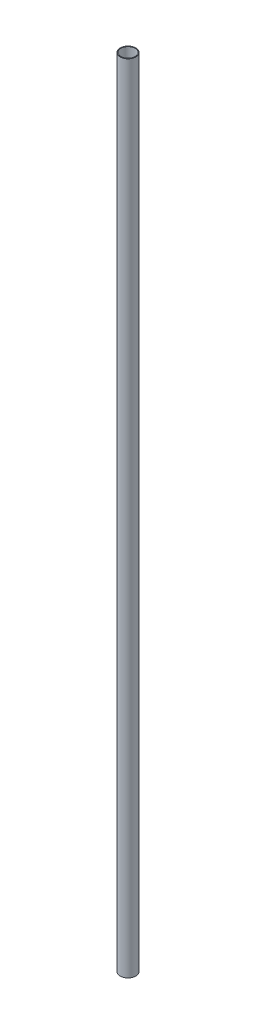
ISO-10303-21;
HEADER;
FILE_DESCRIPTION(('STEP AP214'),'2;1');
FILE_NAME('part.step','',(''),(''),'','','');
FILE_SCHEMA(('AUTOMOTIVE_DESIGN { 1 0 10303 214 1 1 1 1 }'));
ENDSEC;
DATA;
#1=APPLICATION_CONTEXT('core data for automotive mechanical design processes');
#2=APPLICATION_PROTOCOL_DEFINITION('international standard','automotive_design',2000,#1);
#3=PRODUCT_CONTEXT('',#1,'mechanical');
#4=PRODUCT('Part','Part','',(#3));
#5=PRODUCT_RELATED_PRODUCT_CATEGORY('part','',(#4));
#6=PRODUCT_DEFINITION_FORMATION('','',#4);
#7=PRODUCT_DEFINITION_CONTEXT('part definition',#1,'design');
#8=PRODUCT_DEFINITION('design','',#6,#7);
#9=PRODUCT_DEFINITION_SHAPE('','',#8);
#10=(LENGTH_UNIT() NAMED_UNIT(*) SI_UNIT(.MILLI.,.METRE.));
#11=(NAMED_UNIT(*) PLANE_ANGLE_UNIT() SI_UNIT($,.RADIAN.));
#12=(NAMED_UNIT(*) SI_UNIT($,.STERADIAN.) SOLID_ANGLE_UNIT());
#13=UNCERTAINTY_MEASURE_WITH_UNIT(LENGTH_MEASURE(1.E-05),#10,'distance_accuracy_value','');
#14=(GEOMETRIC_REPRESENTATION_CONTEXT(3) GLOBAL_UNCERTAINTY_ASSIGNED_CONTEXT((#13)) GLOBAL_UNIT_ASSIGNED_CONTEXT((#10,
#11,#12)) REPRESENTATION_CONTEXT('',''));
#15=CARTESIAN_POINT('',(0.,0.,0.));
#16=DIRECTION('',(0.,0.,1.));
#17=DIRECTION('',(1.,0.,0.));
#18=AXIS2_PLACEMENT_3D('',#15,#16,#17);
#19=CARTESIAN_POINT('',(0.,1066.8,0.));
#20=DIRECTION('',(0.,1.,0.));
#21=DIRECTION('',(0.,0.,1.));
#22=AXIS2_PLACEMENT_3D('',#19,#20,#21);
#23=PLANE('',#22);
#24=CARTESIAN_POINT('',(0.,1066.8,0.));
#25=DIRECTION('',(0.,1.,0.));
#26=DIRECTION('',(0.,0.,1.));
#27=AXIS2_PLACEMENT_3D('',#24,#25,#26);
#28=CIRCLE('',#27,10.541);
#29=CARTESIAN_POINT('',(0.,1066.8,10.541));
#30=VERTEX_POINT('',#29);
#31=EDGE_CURVE('E12',#30,#30,#28,.T.);
#32=ORIENTED_EDGE('',*,*,#31,.T.);
#33=EDGE_LOOP('',(#32));
#34=FACE_BOUND('',#33,.T.);
#35=CARTESIAN_POINT('',(0.,1066.8,0.));
#36=DIRECTION('',(0.,1.,0.));
#37=DIRECTION('',(0.,0.,1.));
#38=AXIS2_PLACEMENT_3D('',#35,#36,#37);
#39=CIRCLE('',#38,9.525);
#40=CARTESIAN_POINT('',(0.,1066.8,9.525));
#41=VERTEX_POINT('',#40);
#42=EDGE_CURVE('E62',#41,#41,#39,.T.);
#43=ORIENTED_EDGE('',*,*,#42,.F.);
#44=EDGE_LOOP('',(#43));
#45=FACE_BOUND('',#44,.T.);
#46=ADVANCED_FACE('F48',(#34,#45),#23,.T.);
#47=CARTESIAN_POINT('',(0.,0.,0.));
#48=DIRECTION('',(0.,1.,0.));
#49=DIRECTION('',(0.,0.,1.));
#50=AXIS2_PLACEMENT_3D('',#47,#48,#49);
#51=PLANE('',#50);
#52=CARTESIAN_POINT('',(0.,0.,0.));
#53=DIRECTION('',(0.,1.,0.));
#54=DIRECTION('',(0.,0.,1.));
#55=AXIS2_PLACEMENT_3D('',#52,#53,#54);
#56=CIRCLE('',#55,10.541);
#57=CARTESIAN_POINT('',(0.,0.,10.541));
#58=VERTEX_POINT('',#57);
#59=EDGE_CURVE('E52',#58,#58,#56,.T.);
#60=ORIENTED_EDGE('',*,*,#59,.F.);
#61=EDGE_LOOP('',(#60));
#62=FACE_BOUND('',#61,.T.);
#63=CARTESIAN_POINT('',(0.,0.,0.));
#64=DIRECTION('',(0.,1.,0.));
#65=DIRECTION('',(0.,0.,1.));
#66=AXIS2_PLACEMENT_3D('',#63,#64,#65);
#67=CIRCLE('',#66,9.525);
#68=CARTESIAN_POINT('',(0.,0.,9.525));
#69=VERTEX_POINT('',#68);
#70=EDGE_CURVE('E64',#69,#69,#67,.T.);
#71=ORIENTED_EDGE('',*,*,#70,.T.);
#72=EDGE_LOOP('',(#71));
#73=FACE_BOUND('',#72,.T.);
#74=ADVANCED_FACE('F75',(#62,#73),#51,.F.);
#75=CARTESIAN_POINT('',(0.,1066.8,0.));
#76=DIRECTION('',(0.,-1.,0.));
#77=DIRECTION('',(0.,0.,-1.));
#78=AXIS2_PLACEMENT_3D('',#75,#76,#77);
#79=CYLINDRICAL_SURFACE('',#78,10.541);
#80=ORIENTED_EDGE('',*,*,#31,.F.);
#81=EDGE_LOOP('',(#80));
#82=FACE_BOUND('',#81,.T.);
#83=ORIENTED_EDGE('',*,*,#59,.T.);
#84=EDGE_LOOP('',(#83));
#85=FACE_BOUND('',#84,.T.);
#86=ADVANCED_FACE('F50',(#82,#85),#79,.T.);
#87=CARTESIAN_POINT('',(0.,1066.8,0.));
#88=DIRECTION('',(0.,-1.,0.));
#89=DIRECTION('',(0.,0.,-1.));
#90=AXIS2_PLACEMENT_3D('',#87,#88,#89);
#91=CYLINDRICAL_SURFACE('',#90,9.525);
#92=ORIENTED_EDGE('',*,*,#42,.T.);
#93=EDGE_LOOP('',(#92));
#94=FACE_BOUND('',#93,.T.);
#95=ORIENTED_EDGE('',*,*,#70,.F.);
#96=EDGE_LOOP('',(#95));
#97=FACE_BOUND('',#96,.T.);
#98=ADVANCED_FACE('F71',(#94,#97),#91,.F.);
#99=CLOSED_SHELL('',(#46,#74,#86,#98));
#100=MANIFOLD_SOLID_BREP('B2',#99);
#101=ADVANCED_BREP_SHAPE_REPRESENTATION('',(#18,#100),#14);
#102=SHAPE_DEFINITION_REPRESENTATION(#9,#101);
ENDSEC;
END-ISO-10303-21;
